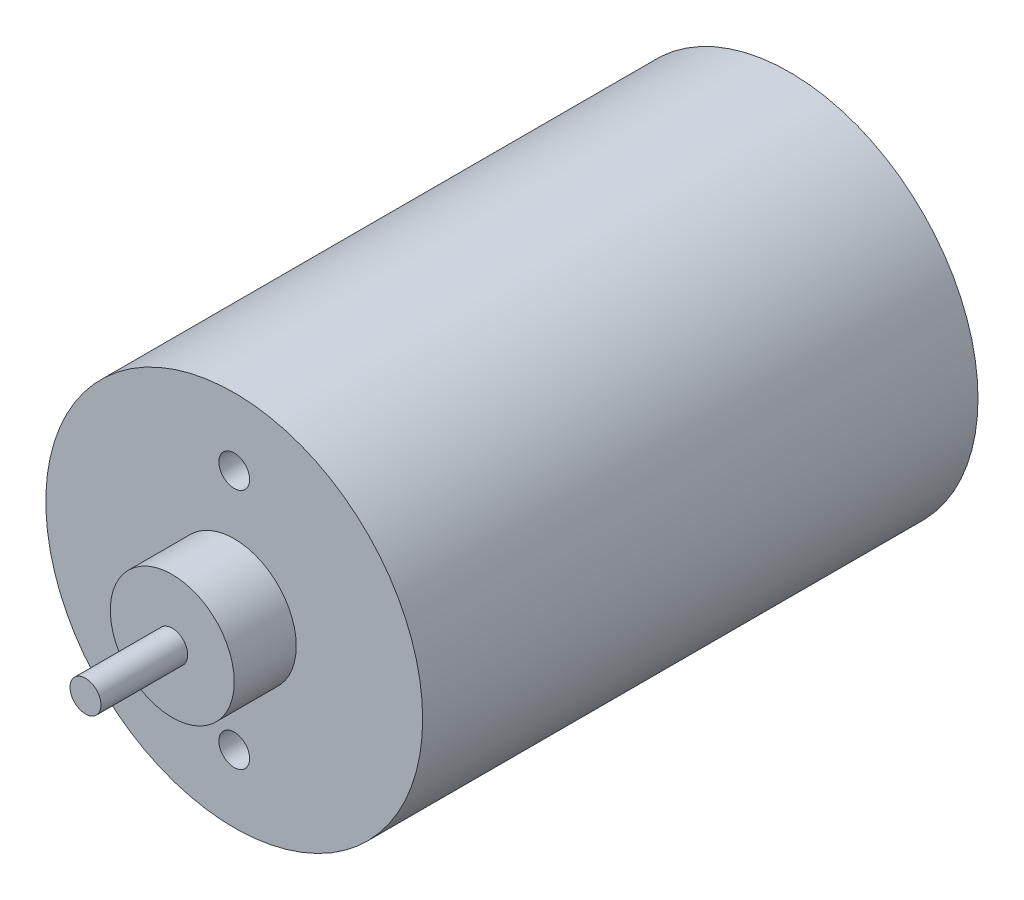
ISO-10303-21;
HEADER;
FILE_DESCRIPTION(('STEP AP214'),'2;1');
FILE_NAME('part.step','',(''),(''),'','','');
FILE_SCHEMA(('AUTOMOTIVE_DESIGN { 1 0 10303 214 1 1 1 1 }'));
ENDSEC;
DATA;
#1=APPLICATION_CONTEXT('core data for automotive mechanical design processes');
#2=APPLICATION_PROTOCOL_DEFINITION('international standard','automotive_design',2000,#1);
#3=PRODUCT_CONTEXT('',#1,'mechanical');
#4=PRODUCT('Part','Part','',(#3));
#5=PRODUCT_RELATED_PRODUCT_CATEGORY('part','',(#4));
#6=PRODUCT_DEFINITION_FORMATION('','',#4);
#7=PRODUCT_DEFINITION_CONTEXT('part definition',#1,'design');
#8=PRODUCT_DEFINITION('design','',#6,#7);
#9=PRODUCT_DEFINITION_SHAPE('','',#8);
#10=(LENGTH_UNIT() NAMED_UNIT(*) SI_UNIT(.MILLI.,.METRE.));
#11=(NAMED_UNIT(*) PLANE_ANGLE_UNIT() SI_UNIT($,.RADIAN.));
#12=(NAMED_UNIT(*) SI_UNIT($,.STERADIAN.) SOLID_ANGLE_UNIT());
#13=UNCERTAINTY_MEASURE_WITH_UNIT(LENGTH_MEASURE(1.E-05),#10,'distance_accuracy_value','');
#14=(GEOMETRIC_REPRESENTATION_CONTEXT(3) GLOBAL_UNCERTAINTY_ASSIGNED_CONTEXT((#13)) GLOBAL_UNIT_ASSIGNED_CONTEXT((#10,
#11,#12)) REPRESENTATION_CONTEXT('',''));
#15=CARTESIAN_POINT('',(0.,0.,0.));
#16=DIRECTION('',(0.,0.,1.));
#17=DIRECTION('',(1.,0.,0.));
#18=AXIS2_PLACEMENT_3D('',#15,#16,#17);
#19=CARTESIAN_POINT('',(0.,0.,56.896));
#20=DIRECTION('',(0.,0.,-1.));
#21=DIRECTION('',(-1.,0.,0.));
#22=AXIS2_PLACEMENT_3D('',#19,#20,#21);
#23=CYLINDRICAL_SURFACE('',#22,19.304);
#24=CARTESIAN_POINT('',(0.,0.,56.896));
#25=DIRECTION('',(0.,0.,1.));
#26=DIRECTION('',(1.,0.,0.));
#27=AXIS2_PLACEMENT_3D('',#24,#25,#26);
#28=CIRCLE('',#27,19.304);
#29=CARTESIAN_POINT('',(19.304,0.,56.896));
#30=VERTEX_POINT('',#29);
#31=EDGE_CURVE('E10',#30,#30,#28,.T.);
#32=ORIENTED_EDGE('',*,*,#31,.F.);
#33=EDGE_LOOP('',(#32));
#34=FACE_BOUND('',#33,.T.);
#35=CARTESIAN_POINT('',(0.,0.,0.));
#36=DIRECTION('',(0.,0.,1.));
#37=DIRECTION('',(1.,0.,0.));
#38=AXIS2_PLACEMENT_3D('',#35,#36,#37);
#39=CIRCLE('',#38,19.304);
#40=CARTESIAN_POINT('',(19.304,0.,0.));
#41=VERTEX_POINT('',#40);
#42=EDGE_CURVE('E34',#41,#41,#39,.T.);
#43=ORIENTED_EDGE('',*,*,#42,.T.);
#44=EDGE_LOOP('',(#43));
#45=FACE_BOUND('',#44,.T.);
#46=ADVANCED_FACE('F31',(#34,#45),#23,.T.);
#47=CARTESIAN_POINT('',(0.,0.,56.896));
#48=DIRECTION('',(0.,0.,1.));
#49=DIRECTION('',(1.,0.,0.));
#50=AXIS2_PLACEMENT_3D('',#47,#48,#49);
#51=PLANE('',#50);
#52=CARTESIAN_POINT('',(0.,-12.3825,56.896));
#53=DIRECTION('',(0.,0.,1.));
#54=DIRECTION('',(1.,0.,0.));
#55=AXIS2_PLACEMENT_3D('',#52,#53,#54);
#56=CIRCLE('',#55,1.575);
#57=CARTESIAN_POINT('',(1.575,-12.3825,56.896));
#58=VERTEX_POINT('',#57);
#59=EDGE_CURVE('E55',#58,#58,#56,.T.);
#60=ORIENTED_EDGE('',*,*,#59,.F.);
#61=EDGE_LOOP('',(#60));
#62=FACE_BOUND('',#61,.T.);
#63=CARTESIAN_POINT('',(0.,12.3825,56.896));
#64=DIRECTION('',(0.,0.,1.));
#65=DIRECTION('',(1.,0.,0.));
#66=AXIS2_PLACEMENT_3D('',#63,#64,#65);
#67=CIRCLE('',#66,1.575);
#68=CARTESIAN_POINT('',(1.575,12.3825,56.896));
#69=VERTEX_POINT('',#68);
#70=EDGE_CURVE('E49',#69,#69,#67,.T.);
#71=ORIENTED_EDGE('',*,*,#70,.F.);
#72=EDGE_LOOP('',(#71));
#73=FACE_BOUND('',#72,.T.);
#74=CARTESIAN_POINT('',(0.,0.,56.896));
#75=DIRECTION('',(0.,0.,1.));
#76=DIRECTION('',(1.,0.,0.));
#77=AXIS2_PLACEMENT_3D('',#74,#75,#76);
#78=CIRCLE('',#77,6.35);
#79=CARTESIAN_POINT('',(6.35,0.,56.896));
#80=VERTEX_POINT('',#79);
#81=EDGE_CURVE('E43',#80,#80,#78,.T.);
#82=ORIENTED_EDGE('',*,*,#81,.F.);
#83=EDGE_LOOP('',(#82));
#84=FACE_BOUND('',#83,.T.);
#85=ORIENTED_EDGE('',*,*,#31,.T.);
#86=EDGE_LOOP('',(#85));
#87=FACE_BOUND('',#86,.T.);
#88=ADVANCED_FACE('F90',(#62,#73,#84,#87),#51,.T.);
#89=CARTESIAN_POINT('',(0.,0.,0.));
#90=DIRECTION('',(0.,0.,1.));
#91=DIRECTION('',(1.,0.,0.));
#92=AXIS2_PLACEMENT_3D('',#89,#90,#91);
#93=PLANE('',#92);
#94=ORIENTED_EDGE('',*,*,#42,.F.);
#95=EDGE_LOOP('',(#94));
#96=FACE_BOUND('',#95,.T.);
#97=ADVANCED_FACE('F86',(#96),#93,.F.);
#98=CARTESIAN_POINT('',(0.,0.,63.246));
#99=DIRECTION('',(0.,0.,-1.));
#100=DIRECTION('',(-1.,0.,0.));
#101=AXIS2_PLACEMENT_3D('',#98,#99,#100);
#102=CYLINDRICAL_SURFACE('',#101,6.35);
#103=CARTESIAN_POINT('',(0.,0.,63.246));
#104=DIRECTION('',(0.,0.,1.));
#105=DIRECTION('',(1.,0.,0.));
#106=AXIS2_PLACEMENT_3D('',#103,#104,#105);
#107=CIRCLE('',#106,6.35);
#108=CARTESIAN_POINT('',(6.35,0.,63.246));
#109=VERTEX_POINT('',#108);
#110=EDGE_CURVE('E41',#109,#109,#107,.T.);
#111=ORIENTED_EDGE('',*,*,#110,.F.);
#112=EDGE_LOOP('',(#111));
#113=FACE_BOUND('',#112,.T.);
#114=ORIENTED_EDGE('',*,*,#81,.T.);
#115=EDGE_LOOP('',(#114));
#116=FACE_BOUND('',#115,.T.);
#117=ADVANCED_FACE('F80',(#113,#116),#102,.T.);
#118=CARTESIAN_POINT('',(0.,0.,63.246));
#119=DIRECTION('',(0.,0.,1.));
#120=DIRECTION('',(1.,0.,0.));
#121=AXIS2_PLACEMENT_3D('',#118,#119,#120);
#122=PLANE('',#121);
#123=CARTESIAN_POINT('',(0.,0.,63.246));
#124=DIRECTION('',(0.,0.,1.));
#125=DIRECTION('',(1.,0.,0.));
#126=AXIS2_PLACEMENT_3D('',#123,#124,#125);
#127=CIRCLE('',#126,1.5875);
#128=CARTESIAN_POINT('',(1.5875,0.,63.246));
#129=VERTEX_POINT('',#128);
#130=EDGE_CURVE('E61',#129,#129,#127,.T.);
#131=ORIENTED_EDGE('',*,*,#130,.F.);
#132=EDGE_LOOP('',(#131));
#133=FACE_BOUND('',#132,.T.);
#134=ORIENTED_EDGE('',*,*,#110,.T.);
#135=EDGE_LOOP('',(#134));
#136=FACE_BOUND('',#135,.T.);
#137=ADVANCED_FACE('F76',(#133,#136),#122,.T.);
#138=CARTESIAN_POINT('',(0.,12.3825,53.721));
#139=DIRECTION('',(0.,0.,1.));
#140=DIRECTION('',(1.,0.,0.));
#141=AXIS2_PLACEMENT_3D('',#138,#139,#140);
#142=CYLINDRICAL_SURFACE('',#141,1.575);
#143=CARTESIAN_POINT('',(0.,12.3825,53.721));
#144=DIRECTION('',(0.,0.,1.));
#145=DIRECTION('',(1.,0.,0.));
#146=AXIS2_PLACEMENT_3D('',#143,#144,#145);
#147=CIRCLE('',#146,1.575);
#148=CARTESIAN_POINT('',(1.575,12.3825,53.721));
#149=VERTEX_POINT('',#148);
#150=EDGE_CURVE('E46',#149,#149,#147,.T.);
#151=ORIENTED_EDGE('',*,*,#150,.F.);
#152=EDGE_LOOP('',(#151));
#153=FACE_BOUND('',#152,.T.);
#154=ORIENTED_EDGE('',*,*,#70,.T.);
#155=EDGE_LOOP('',(#154));
#156=FACE_BOUND('',#155,.T.);
#157=ADVANCED_FACE('F79',(#153,#156),#142,.F.);
#158=CARTESIAN_POINT('',(0.,12.3825,53.721));
#159=DIRECTION('',(0.,0.,1.));
#160=DIRECTION('',(1.,0.,0.));
#161=AXIS2_PLACEMENT_3D('',#158,#159,#160);
#162=PLANE('',#161);
#163=ORIENTED_EDGE('',*,*,#150,.T.);
#164=EDGE_LOOP('',(#163));
#165=FACE_BOUND('',#164,.T.);
#166=ADVANCED_FACE('F105',(#165),#162,.T.);
#167=CARTESIAN_POINT('',(0.,-12.3825,53.721));
#168=DIRECTION('',(0.,0.,1.));
#169=DIRECTION('',(1.,0.,0.));
#170=AXIS2_PLACEMENT_3D('',#167,#168,#169);
#171=CYLINDRICAL_SURFACE('',#170,1.575);
#172=CARTESIAN_POINT('',(0.,-12.3825,53.721));
#173=DIRECTION('',(0.,0.,1.));
#174=DIRECTION('',(1.,0.,0.));
#175=AXIS2_PLACEMENT_3D('',#172,#173,#174);
#176=CIRCLE('',#175,1.575);
#177=CARTESIAN_POINT('',(1.575,-12.3825,53.721));
#178=VERTEX_POINT('',#177);
#179=EDGE_CURVE('E52',#178,#178,#176,.T.);
#180=ORIENTED_EDGE('',*,*,#179,.F.);
#181=EDGE_LOOP('',(#180));
#182=FACE_BOUND('',#181,.T.);
#183=ORIENTED_EDGE('',*,*,#59,.T.);
#184=EDGE_LOOP('',(#183));
#185=FACE_BOUND('',#184,.T.);
#186=ADVANCED_FACE('F109',(#182,#185),#171,.F.);
#187=CARTESIAN_POINT('',(0.,-12.3825,53.721));
#188=DIRECTION('',(0.,0.,1.));
#189=DIRECTION('',(1.,0.,0.));
#190=AXIS2_PLACEMENT_3D('',#187,#188,#189);
#191=PLANE('',#190);
#192=ORIENTED_EDGE('',*,*,#179,.T.);
#193=EDGE_LOOP('',(#192));
#194=FACE_BOUND('',#193,.T.);
#195=ADVANCED_FACE('F72',(#194),#191,.T.);
#196=CARTESIAN_POINT('',(0.,0.,72.136));
#197=DIRECTION('',(0.,0.,-1.));
#198=DIRECTION('',(-1.,0.,0.));
#199=AXIS2_PLACEMENT_3D('',#196,#197,#198);
#200=CYLINDRICAL_SURFACE('',#199,1.5875);
#201=CARTESIAN_POINT('',(0.,0.,72.136));
#202=DIRECTION('',(0.,0.,1.));
#203=DIRECTION('',(1.,0.,0.));
#204=AXIS2_PLACEMENT_3D('',#201,#202,#203);
#205=CIRCLE('',#204,1.5875);
#206=CARTESIAN_POINT('',(1.5875,0.,72.136));
#207=VERTEX_POINT('',#206);
#208=EDGE_CURVE('E58',#207,#207,#205,.T.);
#209=ORIENTED_EDGE('',*,*,#208,.F.);
#210=EDGE_LOOP('',(#209));
#211=FACE_BOUND('',#210,.T.);
#212=ORIENTED_EDGE('',*,*,#130,.T.);
#213=EDGE_LOOP('',(#212));
#214=FACE_BOUND('',#213,.T.);
#215=ADVANCED_FACE('F69',(#211,#214),#200,.T.);
#216=CARTESIAN_POINT('',(0.,0.,72.136));
#217=DIRECTION('',(0.,0.,1.));
#218=DIRECTION('',(1.,0.,0.));
#219=AXIS2_PLACEMENT_3D('',#216,#217,#218);
#220=PLANE('',#219);
#221=ORIENTED_EDGE('',*,*,#208,.T.);
#222=EDGE_LOOP('',(#221));
#223=FACE_BOUND('',#222,.T.);
#224=ADVANCED_FACE('F67',(#223),#220,.T.);
#225=CLOSED_SHELL('',(#46,#88,#97,#117,#137,#157,#166,#186,#195,#215,#224));
#226=MANIFOLD_SOLID_BREP('B2',#225);
#227=ADVANCED_BREP_SHAPE_REPRESENTATION('',(#18,#226),#14);
#228=SHAPE_DEFINITION_REPRESENTATION(#9,#227);
ENDSEC;
END-ISO-10303-21;
